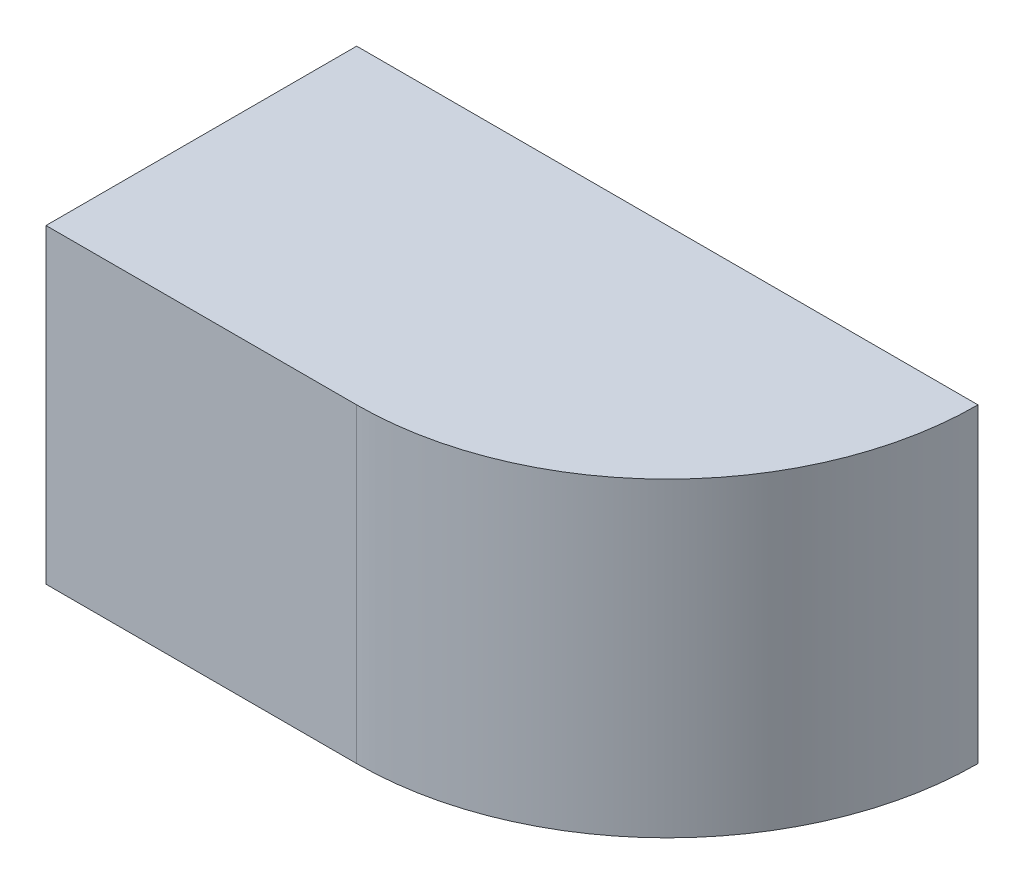
ISO-10303-21;
HEADER;
FILE_DESCRIPTION(('STEP AP214'),'2;1');
FILE_NAME('part.step','',(''),(''),'','','');
FILE_SCHEMA(('AUTOMOTIVE_DESIGN { 1 0 10303 214 1 1 1 1 }'));
ENDSEC;
DATA;
#1=APPLICATION_CONTEXT('core data for automotive mechanical design processes');
#2=APPLICATION_PROTOCOL_DEFINITION('international standard','automotive_design',2000,#1);
#3=PRODUCT_CONTEXT('',#1,'mechanical');
#4=PRODUCT('Part','Part','',(#3));
#5=PRODUCT_RELATED_PRODUCT_CATEGORY('part','',(#4));
#6=PRODUCT_DEFINITION_FORMATION('','',#4);
#7=PRODUCT_DEFINITION_CONTEXT('part definition',#1,'design');
#8=PRODUCT_DEFINITION('design','',#6,#7);
#9=PRODUCT_DEFINITION_SHAPE('','',#8);
#10=(LENGTH_UNIT() NAMED_UNIT(*) SI_UNIT(.MILLI.,.METRE.));
#11=(NAMED_UNIT(*) PLANE_ANGLE_UNIT() SI_UNIT($,.RADIAN.));
#12=(NAMED_UNIT(*) SI_UNIT($,.STERADIAN.) SOLID_ANGLE_UNIT());
#13=UNCERTAINTY_MEASURE_WITH_UNIT(LENGTH_MEASURE(1.E-05),#10,'distance_accuracy_value','');
#14=(GEOMETRIC_REPRESENTATION_CONTEXT(3) GLOBAL_UNCERTAINTY_ASSIGNED_CONTEXT((#13)) GLOBAL_UNIT_ASSIGNED_CONTEXT((#10,
#11,#12)) REPRESENTATION_CONTEXT('',''));
#15=CARTESIAN_POINT('',(0.,0.,0.));
#16=DIRECTION('',(0.,0.,1.));
#17=DIRECTION('',(1.,0.,0.));
#18=AXIS2_PLACEMENT_3D('',#15,#16,#17);
#19=CARTESIAN_POINT('',(2.00000002980232,-3.75000013038516,2.));
#20=DIRECTION('',(0.,0.,1.));
#21=DIRECTION('',(1.,0.,0.));
#22=AXIS2_PLACEMENT_3D('',#19,#20,#21);
#23=PLANE('',#22);
#24=DIRECTION('',(0.,-1.,0.));
#25=VECTOR('',#24,1.);
#26=CARTESIAN_POINT('',(1.50000002235174,-3.50000012665987,2.));
#27=LINE('',#26,#25);
#28=CARTESIAN_POINT('',(1.50000002235174,-3.50000012665987,2.));
#29=VERTEX_POINT('',#28);
#30=CARTESIAN_POINT('',(1.50000002235174,-4.00000013411045,2.));
#31=VERTEX_POINT('',#30);
#32=EDGE_CURVE('E11',#29,#31,#27,.T.);
#33=ORIENTED_EDGE('',*,*,#32,.F.);
#34=DIRECTION('',(-1.,0.,0.));
#35=VECTOR('',#34,1.);
#36=CARTESIAN_POINT('',(2.5000000372529,-3.50000012665987,2.));
#37=LINE('',#36,#35);
#38=CARTESIAN_POINT('',(2.5000000372529,-3.50000012665987,2.));
#39=VERTEX_POINT('',#38);
#40=EDGE_CURVE('E84',#39,#29,#37,.T.);
#41=ORIENTED_EDGE('',*,*,#40,.F.);
#42=DIRECTION('',(0.,1.,0.));
#43=VECTOR('',#42,1.);
#44=CARTESIAN_POINT('',(2.5000000372529,-4.00000013411045,2.));
#45=LINE('',#44,#43);
#46=CARTESIAN_POINT('',(2.5000000372529,-4.00000013411045,2.));
#47=VERTEX_POINT('',#46);
#48=EDGE_CURVE('E83',#47,#39,#45,.T.);
#49=ORIENTED_EDGE('',*,*,#48,.F.);
#50=DIRECTION('',(1.,0.,0.));
#51=VECTOR('',#50,1.);
#52=CARTESIAN_POINT('',(1.50000002235174,-4.00000013411045,2.));
#53=LINE('',#52,#51);
#54=EDGE_CURVE('E26',#31,#47,#53,.T.);
#55=ORIENTED_EDGE('',*,*,#54,.F.);
#56=EDGE_LOOP('',(#33,#41,#49,#55));
#57=FACE_BOUND('',#56,.T.);
#58=ADVANCED_FACE('F17',(#57),#23,.F.);
#59=CARTESIAN_POINT('',(1.50000002235174,-3.50000012665987,2.));
#60=DIRECTION('',(-1.,0.,0.));
#61=DIRECTION('',(0.,0.,1.));
#62=AXIS2_PLACEMENT_3D('',#59,#60,#61);
#63=PLANE('',#62);
#64=ORIENTED_EDGE('',*,*,#32,.T.);
#65=DIRECTION('',(0.,0.,1.));
#66=VECTOR('',#65,1.);
#67=CARTESIAN_POINT('',(1.50000002235174,-4.00000013411045,2.));
#68=LINE('',#67,#66);
#69=CARTESIAN_POINT('',(1.50000002235174,-4.00000013411045,2.5));
#70=VERTEX_POINT('',#69);
#71=EDGE_CURVE('E79',#31,#70,#68,.T.);
#72=ORIENTED_EDGE('',*,*,#71,.T.);
#73=DIRECTION('',(0.,-1.,0.));
#74=VECTOR('',#73,1.);
#75=CARTESIAN_POINT('',(1.50000002235174,-3.50000012665987,2.5));
#76=LINE('',#75,#74);
#77=CARTESIAN_POINT('',(1.50000002235174,-3.50000012665987,2.5));
#78=VERTEX_POINT('',#77);
#79=EDGE_CURVE('E103',#78,#70,#76,.T.);
#80=ORIENTED_EDGE('',*,*,#79,.F.);
#81=DIRECTION('',(0.,0.,1.));
#82=VECTOR('',#81,1.);
#83=CARTESIAN_POINT('',(1.50000002235174,-3.50000012665987,2.));
#84=LINE('',#83,#82);
#85=EDGE_CURVE('E64',#29,#78,#84,.T.);
#86=ORIENTED_EDGE('',*,*,#85,.F.);
#87=EDGE_LOOP('',(#64,#72,#80,#86));
#88=FACE_BOUND('',#87,.T.);
#89=ADVANCED_FACE('F131',(#88),#63,.T.);
#90=CARTESIAN_POINT('',(1.50000002235174,-4.00000013411045,2.));
#91=DIRECTION('',(0.,-1.,0.));
#92=DIRECTION('',(0.,0.,-1.));
#93=AXIS2_PLACEMENT_3D('',#90,#91,#92);
#94=PLANE('',#93);
#95=CARTESIAN_POINT('',(2.0000000372529,-4.00000013411045,2.));
#96=DIRECTION('',(0.,1.,0.));
#97=DIRECTION('',(0.707106781186548,0.,0.707106781186548));
#98=AXIS2_PLACEMENT_3D('',#95,#96,#97);
#99=CIRCLE('',#98,0.5);
#100=CARTESIAN_POINT('',(2.0000000372529,-4.00000013411045,2.5));
#101=VERTEX_POINT('',#100);
#102=EDGE_CURVE('E77',#101,#47,#99,.T.);
#103=ORIENTED_EDGE('',*,*,#102,.F.);
#104=DIRECTION('',(1.,0.,0.));
#105=VECTOR('',#104,1.);
#106=CARTESIAN_POINT('',(1.50000002235174,-4.00000013411045,2.5));
#107=LINE('',#106,#105);
#108=EDGE_CURVE('E104',#70,#101,#107,.T.);
#109=ORIENTED_EDGE('',*,*,#108,.F.);
#110=ORIENTED_EDGE('',*,*,#71,.F.);
#111=ORIENTED_EDGE('',*,*,#54,.T.);
#112=EDGE_LOOP('',(#103,#109,#110,#111));
#113=FACE_BOUND('',#112,.T.);
#114=ADVANCED_FACE('F74',(#113),#94,.T.);
#115=CARTESIAN_POINT('',(2.5000000372529,-3.50000012665987,2.));
#116=DIRECTION('',(0.,1.,0.));
#117=DIRECTION('',(1.,0.,0.));
#118=AXIS2_PLACEMENT_3D('',#115,#116,#117);
#119=PLANE('',#118);
#120=CARTESIAN_POINT('',(2.0000000372529,-3.50000012665987,2.));
#121=DIRECTION('',(0.,-1.,0.));
#122=DIRECTION('',(0.707106781186548,0.,0.707106781186548));
#123=AXIS2_PLACEMENT_3D('',#120,#121,#122);
#124=CIRCLE('',#123,0.5);
#125=CARTESIAN_POINT('',(2.0000000372529,-3.50000012665987,2.5));
#126=VERTEX_POINT('',#125);
#127=EDGE_CURVE('E99',#39,#126,#124,.T.);
#128=ORIENTED_EDGE('',*,*,#127,.F.);
#129=ORIENTED_EDGE('',*,*,#40,.T.);
#130=ORIENTED_EDGE('',*,*,#85,.T.);
#131=DIRECTION('',(-1.,0.,0.));
#132=VECTOR('',#131,1.);
#133=CARTESIAN_POINT('',(2.5000000372529,-3.50000012665987,2.5));
#134=LINE('',#133,#132);
#135=EDGE_CURVE('E89',#126,#78,#134,.T.);
#136=ORIENTED_EDGE('',*,*,#135,.F.);
#137=EDGE_LOOP('',(#128,#129,#130,#136));
#138=FACE_BOUND('',#137,.T.);
#139=ADVANCED_FACE('F19',(#138),#119,.T.);
#140=CARTESIAN_POINT('',(2.00000002980232,-3.75000013038516,2.5));
#141=DIRECTION('',(0.,0.,1.));
#142=DIRECTION('',(1.,0.,0.));
#143=AXIS2_PLACEMENT_3D('',#140,#141,#142);
#144=PLANE('',#143);
#145=DIRECTION('',(0.,-1.,0.));
#146=VECTOR('',#145,1.);
#147=CARTESIAN_POINT('',(2.0000000372529,-3.87500013224781,2.5));
#148=LINE('',#147,#146);
#149=EDGE_CURVE('E92',#126,#101,#148,.T.);
#150=ORIENTED_EDGE('',*,*,#149,.F.);
#151=ORIENTED_EDGE('',*,*,#135,.T.);
#152=ORIENTED_EDGE('',*,*,#79,.T.);
#153=ORIENTED_EDGE('',*,*,#108,.T.);
#154=EDGE_LOOP('',(#150,#151,#152,#153));
#155=FACE_BOUND('',#154,.T.);
#156=ADVANCED_FACE('F121',(#155),#144,.T.);
#157=CARTESIAN_POINT('',(2.0000000372529,-3.87500013224781,2.));
#158=DIRECTION('',(0.,1.,0.));
#159=DIRECTION('',(0.707106781186548,0.,0.707106781186548));
#160=AXIS2_PLACEMENT_3D('',#157,#158,#159);
#161=CYLINDRICAL_SURFACE('',#160,0.5);
#162=ORIENTED_EDGE('',*,*,#127,.T.);
#163=ORIENTED_EDGE('',*,*,#149,.T.);
#164=ORIENTED_EDGE('',*,*,#102,.T.);
#165=ORIENTED_EDGE('',*,*,#48,.T.);
#166=EDGE_LOOP('',(#162,#163,#164,#165));
#167=FACE_BOUND('',#166,.T.);
#168=ADVANCED_FACE('F90',(#167),#161,.T.);
#169=CLOSED_SHELL('',(#58,#89,#114,#139,#156,#168));
#170=MANIFOLD_SOLID_BREP('B1',#169);
#171=ADVANCED_BREP_SHAPE_REPRESENTATION('',(#18,#170),#14);
#172=SHAPE_DEFINITION_REPRESENTATION(#9,#171);
ENDSEC;
END-ISO-10303-21;
